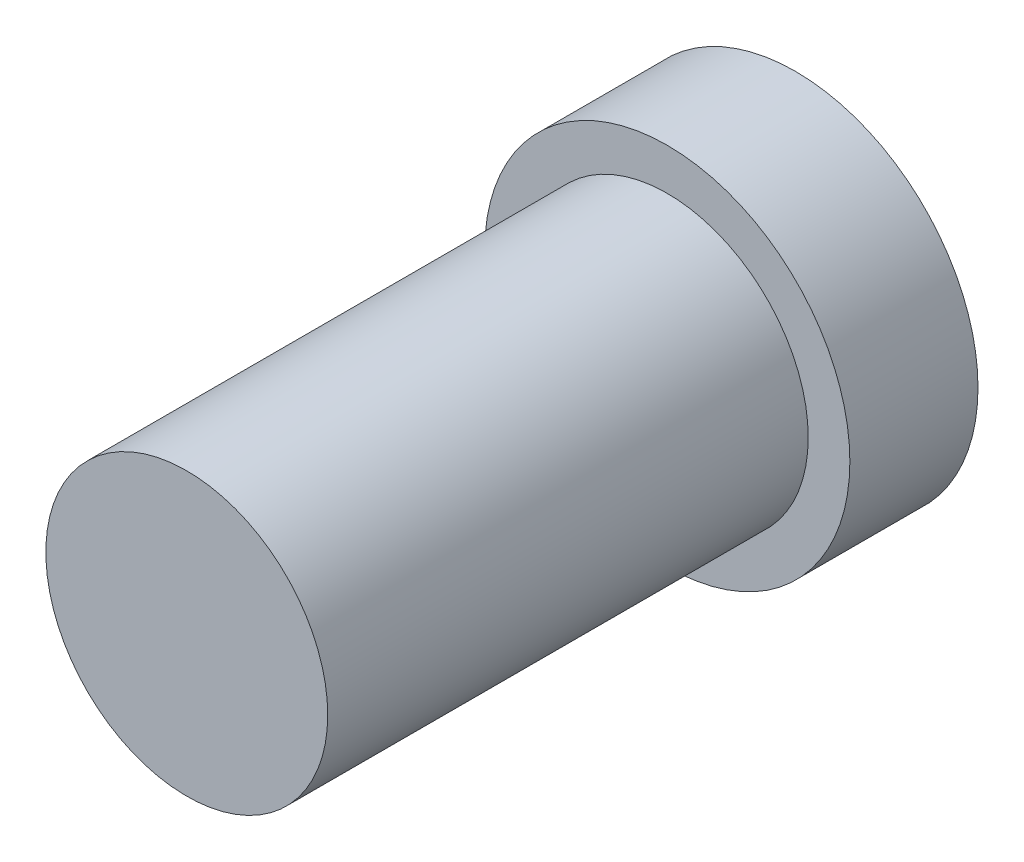
ISO-10303-21;
HEADER;
FILE_DESCRIPTION(('STEP AP214'),'2;1');
FILE_NAME('part.step','',(''),(''),'','','');
FILE_SCHEMA(('AUTOMOTIVE_DESIGN { 1 0 10303 214 1 1 1 1 }'));
ENDSEC;
DATA;
#1=APPLICATION_CONTEXT('core data for automotive mechanical design processes');
#2=APPLICATION_PROTOCOL_DEFINITION('international standard','automotive_design',2000,#1);
#3=PRODUCT_CONTEXT('',#1,'mechanical');
#4=PRODUCT('Part','Part','',(#3));
#5=PRODUCT_RELATED_PRODUCT_CATEGORY('part','',(#4));
#6=PRODUCT_DEFINITION_FORMATION('','',#4);
#7=PRODUCT_DEFINITION_CONTEXT('part definition',#1,'design');
#8=PRODUCT_DEFINITION('design','',#6,#7);
#9=PRODUCT_DEFINITION_SHAPE('','',#8);
#10=(LENGTH_UNIT() NAMED_UNIT(*) SI_UNIT(.MILLI.,.METRE.));
#11=(NAMED_UNIT(*) PLANE_ANGLE_UNIT() SI_UNIT($,.RADIAN.));
#12=(NAMED_UNIT(*) SI_UNIT($,.STERADIAN.) SOLID_ANGLE_UNIT());
#13=UNCERTAINTY_MEASURE_WITH_UNIT(LENGTH_MEASURE(1.E-05),#10,'distance_accuracy_value','');
#14=(GEOMETRIC_REPRESENTATION_CONTEXT(3) GLOBAL_UNCERTAINTY_ASSIGNED_CONTEXT((#13)) GLOBAL_UNIT_ASSIGNED_CONTEXT((#10,
#11,#12)) REPRESENTATION_CONTEXT('',''));
#15=CARTESIAN_POINT('',(0.,0.,0.));
#16=DIRECTION('',(0.,0.,1.));
#17=DIRECTION('',(1.,0.,0.));
#18=AXIS2_PLACEMENT_3D('',#15,#16,#17);
#19=CARTESIAN_POINT('',(0.,0.,0.));
#20=DIRECTION('',(0.,0.,-1.));
#21=DIRECTION('',(-1.,0.,0.));
#22=AXIS2_PLACEMENT_3D('',#19,#20,#21);
#23=PLANE('',#22);
#24=CARTESIAN_POINT('',(0.,0.,0.));
#25=DIRECTION('',(0.,0.,1.));
#26=DIRECTION('',(1.,0.,0.));
#27=AXIS2_PLACEMENT_3D('',#24,#25,#26);
#28=CIRCLE('',#27,22.);
#29=CARTESIAN_POINT('',(22.,0.,0.));
#30=VERTEX_POINT('',#29);
#31=EDGE_CURVE('E10',#30,#30,#28,.T.);
#32=ORIENTED_EDGE('',*,*,#31,.T.);
#33=EDGE_LOOP('',(#32));
#34=FACE_BOUND('',#33,.T.);
#35=ADVANCED_FACE('F31',(#34),#23,.F.);
#36=CARTESIAN_POINT('',(0.,0.,0.));
#37=DIRECTION('',(0.,0.,1.));
#38=DIRECTION('',(1.,0.,0.));
#39=AXIS2_PLACEMENT_3D('',#36,#37,#38);
#40=CYLINDRICAL_SURFACE('',#39,22.);
#41=ORIENTED_EDGE('',*,*,#31,.F.);
#42=EDGE_LOOP('',(#41));
#43=FACE_BOUND('',#42,.T.);
#44=CARTESIAN_POINT('',(0.,0.,-75.));
#45=DIRECTION('',(0.,0.,1.));
#46=DIRECTION('',(1.,0.,0.));
#47=AXIS2_PLACEMENT_3D('',#44,#45,#46);
#48=CIRCLE('',#47,22.);
#49=CARTESIAN_POINT('',(22.,0.,-75.));
#50=VERTEX_POINT('',#49);
#51=EDGE_CURVE('E37',#50,#50,#48,.T.);
#52=ORIENTED_EDGE('',*,*,#51,.T.);
#53=EDGE_LOOP('',(#52));
#54=FACE_BOUND('',#53,.T.);
#55=ADVANCED_FACE('F63',(#43,#54),#40,.T.);
#56=CARTESIAN_POINT('',(-22.,0.,-75.));
#57=DIRECTION('',(0.,0.,-1.));
#58=DIRECTION('',(-1.,0.,0.));
#59=AXIS2_PLACEMENT_3D('',#56,#57,#58);
#60=PLANE('',#59);
#61=ORIENTED_EDGE('',*,*,#51,.F.);
#62=EDGE_LOOP('',(#61));
#63=FACE_BOUND('',#62,.T.);
#64=CARTESIAN_POINT('',(0.,0.,-75.));
#65=DIRECTION('',(0.,0.,1.));
#66=DIRECTION('',(1.,0.,0.));
#67=AXIS2_PLACEMENT_3D('',#64,#65,#66);
#68=CIRCLE('',#67,28.5);
#69=CARTESIAN_POINT('',(28.5,0.,-75.));
#70=VERTEX_POINT('',#69);
#71=EDGE_CURVE('E41',#70,#70,#68,.T.);
#72=ORIENTED_EDGE('',*,*,#71,.T.);
#73=EDGE_LOOP('',(#72));
#74=FACE_BOUND('',#73,.T.);
#75=ADVANCED_FACE('F59',(#63,#74),#60,.F.);
#76=CARTESIAN_POINT('',(0.,0.,0.));
#77=DIRECTION('',(0.,0.,1.));
#78=DIRECTION('',(1.,0.,0.));
#79=AXIS2_PLACEMENT_3D('',#76,#77,#78);
#80=CYLINDRICAL_SURFACE('',#79,28.5);
#81=ORIENTED_EDGE('',*,*,#71,.F.);
#82=EDGE_LOOP('',(#81));
#83=FACE_BOUND('',#82,.T.);
#84=CARTESIAN_POINT('',(0.,0.,-95.));
#85=DIRECTION('',(0.,0.,1.));
#86=DIRECTION('',(1.,0.,0.));
#87=AXIS2_PLACEMENT_3D('',#84,#85,#86);
#88=CIRCLE('',#87,28.5);
#89=CARTESIAN_POINT('',(28.5,0.,-95.));
#90=VERTEX_POINT('',#89);
#91=EDGE_CURVE('E45',#90,#90,#88,.T.);
#92=ORIENTED_EDGE('',*,*,#91,.T.);
#93=EDGE_LOOP('',(#92));
#94=FACE_BOUND('',#93,.T.);
#95=ADVANCED_FACE('F51',(#83,#94),#80,.T.);
#96=CARTESIAN_POINT('',(-28.5,0.,-95.));
#97=DIRECTION('',(0.,0.,1.));
#98=DIRECTION('',(1.,0.,0.));
#99=AXIS2_PLACEMENT_3D('',#96,#97,#98);
#100=PLANE('',#99);
#101=ORIENTED_EDGE('',*,*,#91,.F.);
#102=EDGE_LOOP('',(#101));
#103=FACE_BOUND('',#102,.T.);
#104=ADVANCED_FACE('F53',(#103),#100,.F.);
#105=CLOSED_SHELL('',(#35,#55,#75,#95,#104));
#106=MANIFOLD_SOLID_BREP('B2',#105);
#107=ADVANCED_BREP_SHAPE_REPRESENTATION('',(#18,#106),#14);
#108=SHAPE_DEFINITION_REPRESENTATION(#9,#107);
ENDSEC;
END-ISO-10303-21;
